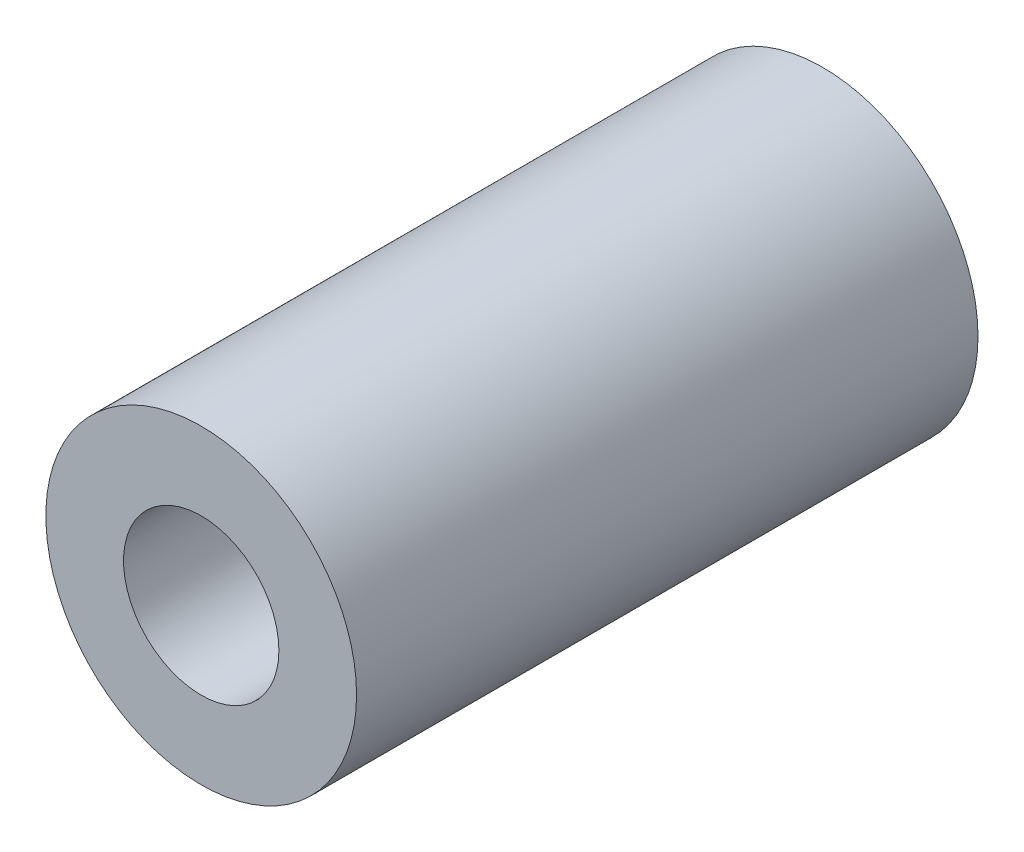
ISO-10303-21;
HEADER;
FILE_DESCRIPTION(('STEP AP214'),'2;1');
FILE_NAME('part.step','',(''),(''),'','','');
FILE_SCHEMA(('AUTOMOTIVE_DESIGN { 1 0 10303 214 1 1 1 1 }'));
ENDSEC;
DATA;
#1=APPLICATION_CONTEXT('core data for automotive mechanical design processes');
#2=APPLICATION_PROTOCOL_DEFINITION('international standard','automotive_design',2000,#1);
#3=PRODUCT_CONTEXT('',#1,'mechanical');
#4=PRODUCT('Part','Part','',(#3));
#5=PRODUCT_RELATED_PRODUCT_CATEGORY('part','',(#4));
#6=PRODUCT_DEFINITION_FORMATION('','',#4);
#7=PRODUCT_DEFINITION_CONTEXT('part definition',#1,'design');
#8=PRODUCT_DEFINITION('design','',#6,#7);
#9=PRODUCT_DEFINITION_SHAPE('','',#8);
#10=(LENGTH_UNIT() NAMED_UNIT(*) SI_UNIT(.MILLI.,.METRE.));
#11=(NAMED_UNIT(*) PLANE_ANGLE_UNIT() SI_UNIT($,.RADIAN.));
#12=(NAMED_UNIT(*) SI_UNIT($,.STERADIAN.) SOLID_ANGLE_UNIT());
#13=UNCERTAINTY_MEASURE_WITH_UNIT(LENGTH_MEASURE(1.E-05),#10,'distance_accuracy_value','');
#14=(GEOMETRIC_REPRESENTATION_CONTEXT(3) GLOBAL_UNCERTAINTY_ASSIGNED_CONTEXT((#13)) GLOBAL_UNIT_ASSIGNED_CONTEXT((#10,
#11,#12)) REPRESENTATION_CONTEXT('',''));
#15=CARTESIAN_POINT('',(0.,0.,0.));
#16=DIRECTION('',(0.,0.,1.));
#17=DIRECTION('',(1.,0.,0.));
#18=AXIS2_PLACEMENT_3D('',#15,#16,#17);
#19=CARTESIAN_POINT('',(0.,0.,10.));
#20=DIRECTION('',(0.,0.,-1.));
#21=DIRECTION('',(-1.,0.,0.));
#22=AXIS2_PLACEMENT_3D('',#19,#20,#21);
#23=CYLINDRICAL_SURFACE('',#22,2.5);
#24=CARTESIAN_POINT('',(0.,0.,10.));
#25=DIRECTION('',(0.,0.,1.));
#26=DIRECTION('',(1.,0.,0.));
#27=AXIS2_PLACEMENT_3D('',#24,#25,#26);
#28=CIRCLE('',#27,2.5);
#29=CARTESIAN_POINT('',(2.5,0.,10.));
#30=VERTEX_POINT('',#29);
#31=EDGE_CURVE('E10',#30,#30,#28,.T.);
#32=ORIENTED_EDGE('',*,*,#31,.F.);
#33=EDGE_LOOP('',(#32));
#34=FACE_BOUND('',#33,.T.);
#35=CARTESIAN_POINT('',(0.,0.,0.));
#36=DIRECTION('',(0.,0.,1.));
#37=DIRECTION('',(1.,0.,0.));
#38=AXIS2_PLACEMENT_3D('',#35,#36,#37);
#39=CIRCLE('',#38,2.5);
#40=CARTESIAN_POINT('',(2.5,0.,0.));
#41=VERTEX_POINT('',#40);
#42=EDGE_CURVE('E39',#41,#41,#39,.T.);
#43=ORIENTED_EDGE('',*,*,#42,.T.);
#44=EDGE_LOOP('',(#43));
#45=FACE_BOUND('',#44,.T.);
#46=ADVANCED_FACE('F36',(#34,#45),#23,.T.);
#47=CARTESIAN_POINT('',(0.,0.,10.));
#48=DIRECTION('',(0.,0.,1.));
#49=DIRECTION('',(1.,0.,0.));
#50=AXIS2_PLACEMENT_3D('',#47,#48,#49);
#51=PLANE('',#50);
#52=CARTESIAN_POINT('',(0.,0.,10.));
#53=DIRECTION('',(0.,0.,1.));
#54=DIRECTION('',(1.,0.,0.));
#55=AXIS2_PLACEMENT_3D('',#52,#53,#54);
#56=CIRCLE('',#55,1.25);
#57=CARTESIAN_POINT('',(1.25,0.,10.));
#58=VERTEX_POINT('',#57);
#59=EDGE_CURVE('E50',#58,#58,#56,.T.);
#60=ORIENTED_EDGE('',*,*,#59,.F.);
#61=EDGE_LOOP('',(#60));
#62=FACE_BOUND('',#61,.T.);
#63=ORIENTED_EDGE('',*,*,#31,.T.);
#64=EDGE_LOOP('',(#63));
#65=FACE_BOUND('',#64,.T.);
#66=ADVANCED_FACE('F56',(#62,#65),#51,.T.);
#67=CARTESIAN_POINT('',(0.,0.,0.));
#68=DIRECTION('',(0.,0.,1.));
#69=DIRECTION('',(1.,0.,0.));
#70=AXIS2_PLACEMENT_3D('',#67,#68,#69);
#71=PLANE('',#70);
#72=CARTESIAN_POINT('',(0.,0.,0.));
#73=DIRECTION('',(0.,0.,1.));
#74=DIRECTION('',(1.,0.,0.));
#75=AXIS2_PLACEMENT_3D('',#72,#73,#74);
#76=CIRCLE('',#75,1.25);
#77=CARTESIAN_POINT('',(1.25,0.,0.));
#78=VERTEX_POINT('',#77);
#79=EDGE_CURVE('E46',#78,#78,#76,.T.);
#80=ORIENTED_EDGE('',*,*,#79,.T.);
#81=EDGE_LOOP('',(#80));
#82=FACE_BOUND('',#81,.T.);
#83=ORIENTED_EDGE('',*,*,#42,.F.);
#84=EDGE_LOOP('',(#83));
#85=FACE_BOUND('',#84,.T.);
#86=ADVANCED_FACE('F58',(#82,#85),#71,.F.);
#87=CARTESIAN_POINT('',(0.,0.,10.));
#88=DIRECTION('',(0.,0.,1.));
#89=DIRECTION('',(1.,0.,0.));
#90=AXIS2_PLACEMENT_3D('',#87,#88,#89);
#91=CYLINDRICAL_SURFACE('',#90,1.25);
#92=ORIENTED_EDGE('',*,*,#79,.F.);
#93=EDGE_LOOP('',(#92));
#94=FACE_BOUND('',#93,.T.);
#95=ORIENTED_EDGE('',*,*,#59,.T.);
#96=EDGE_LOOP('',(#95));
#97=FACE_BOUND('',#96,.T.);
#98=ADVANCED_FACE('F54',(#94,#97),#91,.F.);
#99=CLOSED_SHELL('',(#46,#66,#86,#98));
#100=MANIFOLD_SOLID_BREP('B2',#99);
#101=ADVANCED_BREP_SHAPE_REPRESENTATION('',(#18,#100),#14);
#102=SHAPE_DEFINITION_REPRESENTATION(#9,#101);
ENDSEC;
END-ISO-10303-21;
